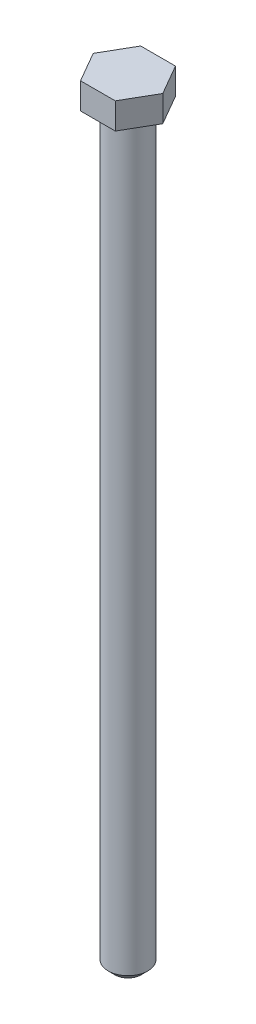
ISO-10303-21;
HEADER;
FILE_DESCRIPTION(('STEP AP214'),'2;1');
FILE_NAME('part.step','',(''),(''),'','','');
FILE_SCHEMA(('AUTOMOTIVE_DESIGN { 1 0 10303 214 1 1 1 1 }'));
ENDSEC;
DATA;
#1=APPLICATION_CONTEXT('core data for automotive mechanical design processes');
#2=APPLICATION_PROTOCOL_DEFINITION('international standard','automotive_design',2000,#1);
#3=PRODUCT_CONTEXT('',#1,'mechanical');
#4=PRODUCT('Part','Part','',(#3));
#5=PRODUCT_RELATED_PRODUCT_CATEGORY('part','',(#4));
#6=PRODUCT_DEFINITION_FORMATION('','',#4);
#7=PRODUCT_DEFINITION_CONTEXT('part definition',#1,'design');
#8=PRODUCT_DEFINITION('design','',#6,#7);
#9=PRODUCT_DEFINITION_SHAPE('','',#8);
#10=(LENGTH_UNIT() NAMED_UNIT(*) SI_UNIT(.MILLI.,.METRE.));
#11=(NAMED_UNIT(*) PLANE_ANGLE_UNIT() SI_UNIT($,.RADIAN.));
#12=(NAMED_UNIT(*) SI_UNIT($,.STERADIAN.) SOLID_ANGLE_UNIT());
#13=UNCERTAINTY_MEASURE_WITH_UNIT(LENGTH_MEASURE(1.E-05),#10,'distance_accuracy_value','');
#14=(GEOMETRIC_REPRESENTATION_CONTEXT(3) GLOBAL_UNCERTAINTY_ASSIGNED_CONTEXT((#13)) GLOBAL_UNIT_ASSIGNED_CONTEXT((#10,
#11,#12)) REPRESENTATION_CONTEXT('',''));
#15=CARTESIAN_POINT('',(0.,0.,0.));
#16=DIRECTION('',(0.,0.,1.));
#17=DIRECTION('',(1.,0.,0.));
#18=AXIS2_PLACEMENT_3D('',#15,#16,#17);
#19=CARTESIAN_POINT('',(8.2635566678842,-6.223,0.));
#20=DIRECTION('',(0.,1.,0.));
#21=DIRECTION('',(0.,0.,1.));
#22=AXIS2_PLACEMENT_3D('',#19,#20,#21);
#23=PLANE('',#22);
#24=DIRECTION('',(0.5,0.,-0.866025403784439));
#25=VECTOR('',#24,1.);
#26=CARTESIAN_POINT('',(4.1317783339421,-6.223,7.15645));
#27=LINE('',#26,#25);
#28=CARTESIAN_POINT('',(4.1317783339421,-6.223,7.15645));
#29=VERTEX_POINT('',#28);
#30=CARTESIAN_POINT('',(8.2635566678842,-6.223,0.));
#31=VERTEX_POINT('',#30);
#32=EDGE_CURVE('E139',#29,#31,#27,.T.);
#33=ORIENTED_EDGE('',*,*,#32,.F.);
#34=DIRECTION('',(1.,0.,0.));
#35=VECTOR('',#34,1.);
#36=CARTESIAN_POINT('',(-4.1317783339421,-6.223,7.15645));
#37=LINE('',#36,#35);
#38=CARTESIAN_POINT('',(-4.1317783339421,-6.223,7.15645));
#39=VERTEX_POINT('',#38);
#40=EDGE_CURVE('E114',#39,#29,#37,.T.);
#41=ORIENTED_EDGE('',*,*,#40,.F.);
#42=DIRECTION('',(0.5,0.,0.866025403784438));
#43=VECTOR('',#42,1.);
#44=CARTESIAN_POINT('',(-8.2635566678842,-6.223,0.));
#45=LINE('',#44,#43);
#46=CARTESIAN_POINT('',(-8.2635566678842,-6.223,0.));
#47=VERTEX_POINT('',#46);
#48=EDGE_CURVE('E99',#47,#39,#45,.T.);
#49=ORIENTED_EDGE('',*,*,#48,.F.);
#50=DIRECTION('',(-0.5,0.,0.866025403784439));
#51=VECTOR('',#50,1.);
#52=CARTESIAN_POINT('',(-4.1317783339421,-6.223,-7.15645));
#53=LINE('',#52,#51);
#54=CARTESIAN_POINT('',(-4.1317783339421,-6.223,-7.15645));
#55=VERTEX_POINT('',#54);
#56=EDGE_CURVE('E112',#55,#47,#53,.T.);
#57=ORIENTED_EDGE('',*,*,#56,.F.);
#58=DIRECTION('',(-1.,0.,0.));
#59=VECTOR('',#58,1.);
#60=CARTESIAN_POINT('',(4.1317783339421,-6.223,-7.15645));
#61=LINE('',#60,#59);
#62=CARTESIAN_POINT('',(4.1317783339421,-6.223,-7.15645));
#63=VERTEX_POINT('',#62);
#64=EDGE_CURVE('E117',#63,#55,#61,.T.);
#65=ORIENTED_EDGE('',*,*,#64,.F.);
#66=DIRECTION('',(-0.5,0.,-0.866025403784438));
#67=VECTOR('',#66,1.);
#68=CARTESIAN_POINT('',(8.2635566678842,-6.223,0.));
#69=LINE('',#68,#67);
#70=EDGE_CURVE('E119',#31,#63,#69,.T.);
#71=ORIENTED_EDGE('',*,*,#70,.F.);
#72=EDGE_LOOP('',(#33,#41,#49,#57,#65,#71));
#73=FACE_BOUND('',#72,.T.);
#74=CARTESIAN_POINT('',(0.,-6.22300000000001,0.));
#75=DIRECTION('',(0.,1.,0.));
#76=DIRECTION('',(0.,0.,1.));
#77=AXIS2_PLACEMENT_3D('',#74,#75,#76);
#78=CIRCLE('',#77,4.699);
#79=CARTESIAN_POINT('',(0.,-6.22300000000001,4.699));
#80=VERTEX_POINT('',#79);
#81=EDGE_CURVE('E141',#80,#80,#78,.F.);
#82=ORIENTED_EDGE('',*,*,#81,.F.);
#83=EDGE_LOOP('',(#82));
#84=FACE_BOUND('',#83,.T.);
#85=ADVANCED_FACE('F36',(#73,#84),#23,.F.);
#86=CARTESIAN_POINT('',(4.1317783339421,-6.223,7.15645));
#87=DIRECTION('',(0.866025403784438,0.,0.5));
#88=DIRECTION('',(0.5,0.,-0.866025403784439));
#89=AXIS2_PLACEMENT_3D('',#86,#87,#88);
#90=PLANE('',#89);
#91=DIRECTION('',(0.5,0.,-0.866025403784439));
#92=VECTOR('',#91,1.);
#93=CARTESIAN_POINT('',(4.1317783339421,0.,7.15645));
#94=LINE('',#93,#92);
#95=CARTESIAN_POINT('',(4.1317783339421,0.,7.15645));
#96=VERTEX_POINT('',#95);
#97=CARTESIAN_POINT('',(8.2635566678842,0.,0.));
#98=VERTEX_POINT('',#97);
#99=EDGE_CURVE('E124',#96,#98,#94,.T.);
#100=ORIENTED_EDGE('',*,*,#99,.F.);
#101=DIRECTION('',(0.,1.,0.));
#102=VECTOR('',#101,1.);
#103=CARTESIAN_POINT('',(4.1317783339421,-6.223,7.15645));
#104=LINE('',#103,#102);
#105=EDGE_CURVE('E53',#29,#96,#104,.T.);
#106=ORIENTED_EDGE('',*,*,#105,.F.);
#107=ORIENTED_EDGE('',*,*,#32,.T.);
#108=DIRECTION('',(0.,1.,0.));
#109=VECTOR('',#108,1.);
#110=CARTESIAN_POINT('',(8.2635566678842,-6.223,0.));
#111=LINE('',#110,#109);
#112=EDGE_CURVE('E88',#31,#98,#111,.T.);
#113=ORIENTED_EDGE('',*,*,#112,.T.);
#114=EDGE_LOOP('',(#100,#106,#107,#113));
#115=FACE_BOUND('',#114,.T.);
#116=ADVANCED_FACE('F162',(#115),#90,.T.);
#117=CARTESIAN_POINT('',(-4.1317783339421,-6.223,7.15645));
#118=DIRECTION('',(0.,0.,1.));
#119=DIRECTION('',(1.,0.,0.));
#120=AXIS2_PLACEMENT_3D('',#117,#118,#119);
#121=PLANE('',#120);
#122=DIRECTION('',(1.,0.,0.));
#123=VECTOR('',#122,1.);
#124=CARTESIAN_POINT('',(-4.1317783339421,0.,7.15645));
#125=LINE('',#124,#123);
#126=CARTESIAN_POINT('',(-4.1317783339421,0.,7.15645));
#127=VERTEX_POINT('',#126);
#128=EDGE_CURVE('E136',#127,#96,#125,.T.);
#129=ORIENTED_EDGE('',*,*,#128,.F.);
#130=DIRECTION('',(0.,1.,0.));
#131=VECTOR('',#130,1.);
#132=CARTESIAN_POINT('',(-4.1317783339421,-6.223,7.15645));
#133=LINE('',#132,#131);
#134=EDGE_CURVE('E76',#39,#127,#133,.T.);
#135=ORIENTED_EDGE('',*,*,#134,.F.);
#136=ORIENTED_EDGE('',*,*,#40,.T.);
#137=ORIENTED_EDGE('',*,*,#105,.T.);
#138=EDGE_LOOP('',(#129,#135,#136,#137));
#139=FACE_BOUND('',#138,.T.);
#140=ADVANCED_FACE('F167',(#139),#121,.T.);
#141=CARTESIAN_POINT('',(-8.2635566678842,-6.223,0.));
#142=DIRECTION('',(-0.866025403784438,0.,0.5));
#143=DIRECTION('',(0.5,0.,0.866025403784439));
#144=AXIS2_PLACEMENT_3D('',#141,#142,#143);
#145=PLANE('',#144);
#146=DIRECTION('',(0.5,0.,0.866025403784438));
#147=VECTOR('',#146,1.);
#148=CARTESIAN_POINT('',(-8.2635566678842,0.,0.));
#149=LINE('',#148,#147);
#150=CARTESIAN_POINT('',(-8.2635566678842,0.,0.));
#151=VERTEX_POINT('',#150);
#152=EDGE_CURVE('E101',#151,#127,#149,.T.);
#153=ORIENTED_EDGE('',*,*,#152,.F.);
#154=DIRECTION('',(0.,1.,0.));
#155=VECTOR('',#154,1.);
#156=CARTESIAN_POINT('',(-8.2635566678842,-6.223,0.));
#157=LINE('',#156,#155);
#158=EDGE_CURVE('E96',#47,#151,#157,.T.);
#159=ORIENTED_EDGE('',*,*,#158,.F.);
#160=ORIENTED_EDGE('',*,*,#48,.T.);
#161=ORIENTED_EDGE('',*,*,#134,.T.);
#162=EDGE_LOOP('',(#153,#159,#160,#161));
#163=FACE_BOUND('',#162,.T.);
#164=ADVANCED_FACE('F98',(#163),#145,.T.);
#165=CARTESIAN_POINT('',(-4.1317783339421,-6.223,-7.15645));
#166=DIRECTION('',(-0.866025403784438,0.,-0.5));
#167=DIRECTION('',(-0.5,0.,0.866025403784439));
#168=AXIS2_PLACEMENT_3D('',#165,#166,#167);
#169=PLANE('',#168);
#170=DIRECTION('',(-0.5,0.,0.866025403784439));
#171=VECTOR('',#170,1.);
#172=CARTESIAN_POINT('',(-4.1317783339421,0.,-7.15645));
#173=LINE('',#172,#171);
#174=CARTESIAN_POINT('',(-4.1317783339421,0.,-7.15645));
#175=VERTEX_POINT('',#174);
#176=EDGE_CURVE('E133',#175,#151,#173,.T.);
#177=ORIENTED_EDGE('',*,*,#176,.F.);
#178=DIRECTION('',(0.,1.,0.));
#179=VECTOR('',#178,1.);
#180=CARTESIAN_POINT('',(-4.1317783339421,-6.223,-7.15645));
#181=LINE('',#180,#179);
#182=EDGE_CURVE('E106',#55,#175,#181,.T.);
#183=ORIENTED_EDGE('',*,*,#182,.F.);
#184=ORIENTED_EDGE('',*,*,#56,.T.);
#185=ORIENTED_EDGE('',*,*,#158,.T.);
#186=EDGE_LOOP('',(#177,#183,#184,#185));
#187=FACE_BOUND('',#186,.T.);
#188=ADVANCED_FACE('F116',(#187),#169,.T.);
#189=CARTESIAN_POINT('',(4.1317783339421,-6.223,-7.15645));
#190=DIRECTION('',(0.,0.,-1.));
#191=DIRECTION('',(-1.,0.,0.));
#192=AXIS2_PLACEMENT_3D('',#189,#190,#191);
#193=PLANE('',#192);
#194=DIRECTION('',(-1.,0.,0.));
#195=VECTOR('',#194,1.);
#196=CARTESIAN_POINT('',(4.1317783339421,0.,-7.15645));
#197=LINE('',#196,#195);
#198=CARTESIAN_POINT('',(4.1317783339421,0.,-7.15645));
#199=VERTEX_POINT('',#198);
#200=EDGE_CURVE('E130',#199,#175,#197,.T.);
#201=ORIENTED_EDGE('',*,*,#200,.F.);
#202=DIRECTION('',(0.,1.,0.));
#203=VECTOR('',#202,1.);
#204=CARTESIAN_POINT('',(4.1317783339421,-6.223,-7.15645));
#205=LINE('',#204,#203);
#206=EDGE_CURVE('E144',#63,#199,#205,.T.);
#207=ORIENTED_EDGE('',*,*,#206,.F.);
#208=ORIENTED_EDGE('',*,*,#64,.T.);
#209=ORIENTED_EDGE('',*,*,#182,.T.);
#210=EDGE_LOOP('',(#201,#207,#208,#209));
#211=FACE_BOUND('',#210,.T.);
#212=ADVANCED_FACE('F181',(#211),#193,.T.);
#213=CARTESIAN_POINT('',(8.2635566678842,-6.223,0.));
#214=DIRECTION('',(0.866025403784438,0.,-0.5));
#215=DIRECTION('',(-0.5,0.,-0.866025403784439));
#216=AXIS2_PLACEMENT_3D('',#213,#214,#215);
#217=PLANE('',#216);
#218=DIRECTION('',(-0.5,0.,-0.866025403784438));
#219=VECTOR('',#218,1.);
#220=CARTESIAN_POINT('',(8.2635566678842,0.,0.));
#221=LINE('',#220,#219);
#222=EDGE_CURVE('E127',#98,#199,#221,.T.);
#223=ORIENTED_EDGE('',*,*,#222,.F.);
#224=ORIENTED_EDGE('',*,*,#112,.F.);
#225=ORIENTED_EDGE('',*,*,#70,.T.);
#226=ORIENTED_EDGE('',*,*,#206,.T.);
#227=EDGE_LOOP('',(#223,#224,#225,#226));
#228=FACE_BOUND('',#227,.T.);
#229=ADVANCED_FACE('F173',(#228),#217,.T.);
#230=CARTESIAN_POINT('',(8.2635566678842,0.,0.));
#231=DIRECTION('',(0.,1.,0.));
#232=DIRECTION('',(0.,0.,1.));
#233=AXIS2_PLACEMENT_3D('',#230,#231,#232);
#234=PLANE('',#233);
#235=ORIENTED_EDGE('',*,*,#99,.T.);
#236=ORIENTED_EDGE('',*,*,#222,.T.);
#237=ORIENTED_EDGE('',*,*,#200,.T.);
#238=ORIENTED_EDGE('',*,*,#176,.T.);
#239=ORIENTED_EDGE('',*,*,#152,.T.);
#240=ORIENTED_EDGE('',*,*,#128,.T.);
#241=EDGE_LOOP('',(#235,#236,#237,#238,#239,#240));
#242=FACE_BOUND('',#241,.T.);
#243=ADVANCED_FACE('F170',(#242),#234,.T.);
#244=CARTESIAN_POINT('',(0.,-184.023,0.));
#245=DIRECTION('',(0.,1.,0.));
#246=DIRECTION('',(0.,0.,1.));
#247=AXIS2_PLACEMENT_3D('',#244,#245,#246);
#248=CYLINDRICAL_SURFACE('',#247,4.699);
#249=CARTESIAN_POINT('',(0.,-182.4355,0.));
#250=DIRECTION('',(0.,-1.,0.));
#251=DIRECTION('',(0.,0.,-1.));
#252=AXIS2_PLACEMENT_3D('',#249,#250,#251);
#253=CIRCLE('',#252,4.699);
#254=CARTESIAN_POINT('',(0.,-182.4355,-4.699));
#255=VERTEX_POINT('',#254);
#256=EDGE_CURVE('E11',#255,#255,#253,.F.);
#257=ORIENTED_EDGE('',*,*,#256,.T.);
#258=EDGE_LOOP('',(#257));
#259=FACE_BOUND('',#258,.T.);
#260=ORIENTED_EDGE('',*,*,#81,.T.);
#261=EDGE_LOOP('',(#260));
#262=FACE_BOUND('',#261,.T.);
#263=ADVANCED_FACE('F158',(#259,#262),#248,.T.);
#264=CARTESIAN_POINT('',(0.,-184.023,0.));
#265=DIRECTION('',(0.,-1.,0.));
#266=DIRECTION('',(0.,0.,-1.));
#267=AXIS2_PLACEMENT_3D('',#264,#265,#266);
#268=PLANE('',#267);
#269=CARTESIAN_POINT('',(0.,-184.023,0.));
#270=DIRECTION('',(0.,-1.,0.));
#271=DIRECTION('',(0.,0.,-1.));
#272=AXIS2_PLACEMENT_3D('',#269,#270,#271);
#273=CIRCLE('',#272,3.11149999999999);
#274=CARTESIAN_POINT('',(0.,-184.023,-3.11149999999999));
#275=VERTEX_POINT('',#274);
#276=EDGE_CURVE('E45',#275,#275,#273,.T.);
#277=ORIENTED_EDGE('',*,*,#276,.T.);
#278=EDGE_LOOP('',(#277));
#279=FACE_BOUND('',#278,.T.);
#280=ADVANCED_FACE('F151',(#279),#268,.T.);
#281=CARTESIAN_POINT('',(0.,-184.023,0.));
#282=DIRECTION('',(0.,1.,0.));
#283=DIRECTION('',(0.,0.,1.));
#284=AXIS2_PLACEMENT_3D('',#281,#282,#283);
#285=CONICAL_SURFACE('',#284,3.11149999999999,0.785398163397446);
#286=ORIENTED_EDGE('',*,*,#256,.F.);
#287=EDGE_LOOP('',(#286));
#288=FACE_BOUND('',#287,.T.);
#289=ORIENTED_EDGE('',*,*,#276,.F.);
#290=EDGE_LOOP('',(#289));
#291=FACE_BOUND('',#290,.T.);
#292=ADVANCED_FACE('F38',(#288,#291),#285,.T.);
#293=CLOSED_SHELL('',(#85,#116,#140,#164,#188,#212,#229,#243,#263,#280,#292));
#294=MANIFOLD_SOLID_BREP('B2',#293);
#295=ADVANCED_BREP_SHAPE_REPRESENTATION('',(#18,#294),#14);
#296=SHAPE_DEFINITION_REPRESENTATION(#9,#295);
ENDSEC;
END-ISO-10303-21;
